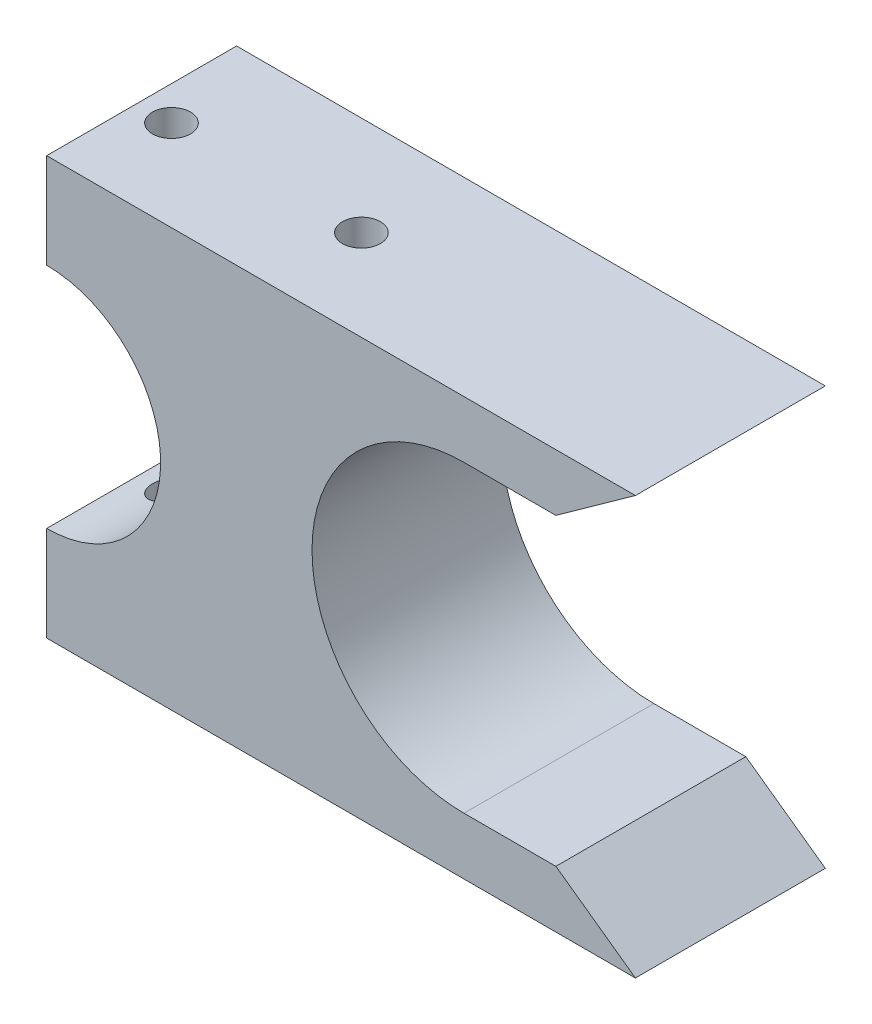
ISO-10303-21;
HEADER;
FILE_DESCRIPTION(('STEP AP214'),'2;1');
FILE_NAME('part.step','',(''),(''),'','','');
FILE_SCHEMA(('AUTOMOTIVE_DESIGN { 1 0 10303 214 1 1 1 1 }'));
ENDSEC;
DATA;
#1=APPLICATION_CONTEXT('core data for automotive mechanical design processes');
#2=APPLICATION_PROTOCOL_DEFINITION('international standard','automotive_design',2000,#1);
#3=PRODUCT_CONTEXT('',#1,'mechanical');
#4=PRODUCT('Part','Part','',(#3));
#5=PRODUCT_RELATED_PRODUCT_CATEGORY('part','',(#4));
#6=PRODUCT_DEFINITION_FORMATION('','',#4);
#7=PRODUCT_DEFINITION_CONTEXT('part definition',#1,'design');
#8=PRODUCT_DEFINITION('design','',#6,#7);
#9=PRODUCT_DEFINITION_SHAPE('','',#8);
#10=(LENGTH_UNIT() NAMED_UNIT(*) SI_UNIT(.MILLI.,.METRE.));
#11=(NAMED_UNIT(*) PLANE_ANGLE_UNIT() SI_UNIT($,.RADIAN.));
#12=(NAMED_UNIT(*) SI_UNIT($,.STERADIAN.) SOLID_ANGLE_UNIT());
#13=UNCERTAINTY_MEASURE_WITH_UNIT(LENGTH_MEASURE(1.E-05),#10,'distance_accuracy_value','');
#14=(GEOMETRIC_REPRESENTATION_CONTEXT(3) GLOBAL_UNCERTAINTY_ASSIGNED_CONTEXT((#13)) GLOBAL_UNIT_ASSIGNED_CONTEXT((#10,
#11,#12)) REPRESENTATION_CONTEXT('',''));
#15=CARTESIAN_POINT('',(0.,0.,0.));
#16=DIRECTION('',(0.,0.,1.));
#17=DIRECTION('',(1.,0.,0.));
#18=AXIS2_PLACEMENT_3D('',#15,#16,#17);
#19=CARTESIAN_POINT('',(-13.9719150316954,11.,10.));
#20=DIRECTION('',(1.,0.,0.));
#21=DIRECTION('',(0.,0.,-1.));
#22=AXIS2_PLACEMENT_3D('',#19,#20,#21);
#23=PLANE('',#22);
#24=DIRECTION('',(0.,-1.,0.));
#25=VECTOR('',#24,1.);
#26=CARTESIAN_POINT('',(-13.9719150316954,11.,0.));
#27=LINE('',#26,#25);
#28=CARTESIAN_POINT('',(-13.9719150316954,11.,0.));
#29=VERTEX_POINT('',#28);
#30=CARTESIAN_POINT('',(-13.9719150316954,6.,0.));
#31=VERTEX_POINT('',#30);
#32=EDGE_CURVE('E130',#29,#31,#27,.T.);
#33=ORIENTED_EDGE('',*,*,#32,.T.);
#34=DIRECTION('',(0.,0.,-1.));
#35=VECTOR('',#34,1.);
#36=CARTESIAN_POINT('',(-13.9719150316954,6.,10.));
#37=LINE('',#36,#35);
#38=CARTESIAN_POINT('',(-13.9719150316954,6.,10.));
#39=VERTEX_POINT('',#38);
#40=EDGE_CURVE('E11',#39,#31,#37,.T.);
#41=ORIENTED_EDGE('',*,*,#40,.F.);
#42=DIRECTION('',(0.,-1.,0.));
#43=VECTOR('',#42,1.);
#44=CARTESIAN_POINT('',(-13.9719150316954,11.,10.));
#45=LINE('',#44,#43);
#46=CARTESIAN_POINT('',(-13.9719150316954,11.,10.));
#47=VERTEX_POINT('',#46);
#48=EDGE_CURVE('E148',#47,#39,#45,.T.);
#49=ORIENTED_EDGE('',*,*,#48,.F.);
#50=DIRECTION('',(0.,0.,-1.));
#51=VECTOR('',#50,1.);
#52=CARTESIAN_POINT('',(-13.9719150316954,11.,10.));
#53=LINE('',#52,#51);
#54=EDGE_CURVE('E126',#47,#29,#53,.T.);
#55=ORIENTED_EDGE('',*,*,#54,.T.);
#56=EDGE_LOOP('',(#33,#41,#49,#55));
#57=FACE_BOUND('',#56,.T.);
#58=ADVANCED_FACE('F42',(#57),#23,.F.);
#59=CARTESIAN_POINT('',(-13.9719150316954,0.,10.));
#60=DIRECTION('',(0.,0.,-1.));
#61=DIRECTION('',(-1.,0.,0.));
#62=AXIS2_PLACEMENT_3D('',#59,#60,#61);
#63=CYLINDRICAL_SURFACE('',#62,6.);
#64=CARTESIAN_POINT('',(-12.1745205373334,-5.72445395052117,6.22427573403661));
#65=CARTESIAN_POINT('',(-12.2303560263032,-5.74198475317125,6.22427421741959));
#66=CARTESIAN_POINT('',(-12.2864707697377,-5.75869884831585,6.21958843247634));
#67=CARTESIAN_POINT('',(-12.3976859292133,-5.79009024664277,6.20068753949421));
#68=CARTESIAN_POINT('',(-12.4527859569581,-5.80476678361486,6.18646885832605));
#69=CARTESIAN_POINT('',(-12.5603533138965,-5.83185865027265,6.14860681839455));
#70=CARTESIAN_POINT('',(-12.6128163953193,-5.84427041127206,6.12494876943051));
#71=CARTESIAN_POINT('',(-12.7132721442532,-5.86672567427537,6.0687039139969));
#72=CARTESIAN_POINT('',(-12.7612656340706,-5.87676961242923,6.03611875428442));
#73=CARTESIAN_POINT('',(-12.849770594221,-5.89429977550822,5.96400329942319));
#74=CARTESIAN_POINT('',(-12.8904650835414,-5.90185443826801,5.92471409241819));
#75=CARTESIAN_POINT('',(-12.9647771002944,-5.91498950051749,5.8396482354895));
#76=CARTESIAN_POINT('',(-12.9983951910958,-5.9205700571945,5.79387210249115));
#77=CARTESIAN_POINT('',(-13.0569438750368,-5.92989836811523,5.69801446302989));
#78=CARTESIAN_POINT('',(-13.0820166624467,-5.93367658734467,5.64802268051759));
#79=CARTESIAN_POINT('',(-13.1235077017253,-5.93975144756019,5.54448429415539));
#80=CARTESIAN_POINT('',(-13.1399261611389,-5.94204812407638,5.49093777558857));
#81=CARTESIAN_POINT('',(-13.1635770696567,-5.9453118803599,5.38196932438098));
#82=CARTESIAN_POINT('',(-13.1708346161125,-5.9462825933563,5.32655294453006));
#83=CARTESIAN_POINT('',(-13.1760300562808,-5.94698027031004,5.21527699033676));
#84=CARTESIAN_POINT('',(-13.1739679295507,-5.94670723153923,5.15941741502252));
#85=CARTESIAN_POINT('',(-13.1605821409134,-5.94489560002012,5.04881337509116));
#86=CARTESIAN_POINT('',(-13.1492541408148,-5.94335641447239,4.99406944511557));
#87=CARTESIAN_POINT('',(-13.1176715238276,-5.93889891193022,4.88727950221414));
#88=CARTESIAN_POINT('',(-13.0974170025345,-5.93598060970493,4.8352334604029));
#89=CARTESIAN_POINT('',(-13.0486058341363,-5.92858382299302,4.73533364138175));
#90=CARTESIAN_POINT('',(-13.0200519044498,-5.92410584908401,4.68747849863773));
#91=CARTESIAN_POINT('',(-12.9555234235957,-5.91337586373584,4.59729192362205));
#92=CARTESIAN_POINT('',(-12.9195491060715,-5.90712390815116,4.55496031750099));
#93=CARTESIAN_POINT('',(-12.8412827707284,-5.89264384011893,4.4769589710601));
#94=CARTESIAN_POINT('',(-12.7989870104907,-5.88441455528785,4.44129320538944));
#95=CARTESIAN_POINT('',(-12.7094219995698,-5.86585030537105,4.37757547440227));
#96=CARTESIAN_POINT('',(-12.6621527052274,-5.85551532180015,4.3495235759302));
#97=CARTESIAN_POINT('',(-12.563596594753,-5.83259988809157,4.30142309854288));
#98=CARTESIAN_POINT('',(-12.5122740214314,-5.81999781157659,4.28145822077442));
#99=CARTESIAN_POINT('',(-12.4075671012963,-5.79273187989704,4.25027627490168));
#100=CARTESIAN_POINT('',(-12.3541824798082,-5.77806774936537,4.23906037644963));
#101=CARTESIAN_POINT('',(-12.2451450804135,-5.74644117548867,4.22521299793434));
#102=CARTESIAN_POINT('',(-12.1894736446552,-5.72942111626551,4.22286150106131));
#103=CARTESIAN_POINT('',(-12.0789878572315,-5.69387376476382,4.22731389284813));
#104=CARTESIAN_POINT('',(-12.0241737264217,-5.67534609148326,4.23412010262388));
#105=CARTESIAN_POINT('',(-11.9140158883382,-5.63636698293885,4.25708400851638));
#106=CARTESIAN_POINT('',(-11.8587842218214,-5.615865659203,4.27369485323868));
#107=CARTESIAN_POINT('',(-11.7520675806708,-5.57454538747228,4.31607298031157));
#108=CARTESIAN_POINT('',(-11.7005838472488,-5.55372633699135,4.34184327954961));
#109=CARTESIAN_POINT('',(-11.6007604065539,-5.51186580896186,4.40308379610853));
#110=CARTESIAN_POINT('',(-11.5526136147971,-5.49084576864629,4.43888440936687));
#111=CARTESIAN_POINT('',(-11.4630874717055,-5.45052273753934,4.51896102598171));
#112=CARTESIAN_POINT('',(-11.4217085474063,-5.43121985513138,4.56323756376576));
#113=CARTESIAN_POINT('',(-11.3481141742477,-5.39604429216369,4.65809272976502));
#114=CARTESIAN_POINT('',(-11.3156929063767,-5.38009702022826,4.7084830066191));
#115=CARTESIAN_POINT('',(-11.2600728280974,-5.35227854883663,4.81513895987086));
#116=CARTESIAN_POINT('',(-11.2368655517442,-5.34040360903801,4.8713991825674));
#117=CARTESIAN_POINT('',(-11.2027114334756,-5.32276672447667,4.9821873743734));
#118=CARTESIAN_POINT('',(-11.1907754821761,-5.3165146148453,5.03633200615066));
#119=CARTESIAN_POINT('',(-11.1760396260742,-5.30878087206615,5.14617392908685));
#120=CARTESIAN_POINT('',(-11.1732335656542,-5.30729602471107,5.20187014856059));
#121=CARTESIAN_POINT('',(-11.1767356630798,-5.30914037639137,5.30780684069654));
#122=CARTESIAN_POINT('',(-11.1822401467101,-5.31204510440246,5.35808391191686));
#123=CARTESIAN_POINT('',(-11.2006515149787,-5.32167315887307,5.4568778260449));
#124=CARTESIAN_POINT('',(-11.213558541865,-5.32839655871252,5.50539463510821));
#125=CARTESIAN_POINT('',(-11.2462930285912,-5.34521482015498,5.59963461465897));
#126=CARTESIAN_POINT('',(-11.2661501254549,-5.35532411205852,5.6453448198555));
#127=CARTESIAN_POINT('',(-11.3120508741512,-5.37826917026009,5.73279011930976));
#128=CARTESIAN_POINT('',(-11.3380962472841,-5.39110569504641,5.7745241030283));
#129=CARTESIAN_POINT('',(-11.3981277473951,-5.42003884788685,5.85675270957285));
#130=CARTESIAN_POINT('',(-11.432609299537,-5.43632246105458,5.89681931429448));
#131=CARTESIAN_POINT('',(-11.5070304622127,-5.47046805794327,5.97074164724692));
#132=CARTESIAN_POINT('',(-11.5469734198206,-5.48833100718448,6.00459353669269));
#133=CARTESIAN_POINT('',(-11.6356206422367,-5.52668838425846,6.06858968827896));
#134=CARTESIAN_POINT('',(-11.6848016302172,-5.54726730357483,6.09802436962138));
#135=CARTESIAN_POINT('',(-11.7874180639088,-5.5884724881989,6.14807661609864));
#136=CARTESIAN_POINT('',(-11.8408516228064,-5.60909872860905,6.16869806597));
#137=CARTESIAN_POINT('',(-11.9407477833069,-5.6459421805186,6.19769502535803));
#138=CARTESIAN_POINT('',(-11.9867236736132,-5.66228220439649,6.20761066493147));
#139=CARTESIAN_POINT('',(-12.0799061861796,-5.69409567683618,6.22090138501089));
#140=CARTESIAN_POINT('',(-12.1271127034296,-5.70956919898464,6.22427702173963));
#141=CARTESIAN_POINT('',(-12.1745205373334,-5.72445395052117,6.22427573403661));
#142=B_SPLINE_CURVE_WITH_KNOTS('',3,(#64,#65,#66,#67,#68,#69,#70,#71,#72,#73,#74,#75,#76,#77,
#78,#79,#80,#81,#82,#83,#84,#85,#86,#87,#88,#89,#90,#91,#92,#93,#94,#95,#96,#97,#98,#99,#100,
#101,#102,#103,#104,#105,#106,#107,#108,#109,#110,#111,#112,#113,#114,#115,#116,#117,#118,#119,
#120,#121,#122,#123,#124,#125,#126,#127,#128,#129,#130,#131,#132,#133,#134,#135,#136,#137,#138,
#139,#140,#141),.UNSPECIFIED.,.T.,.F.,(4,2,2,2,2,2,2,2,2,2,2,2,2,2,2,2,2,2,2,2,2,2,2,2,2,2,2,2,
2,2,2,2,2,2,2,2,2,2,4),(0.,0.175401601977453,0.350868984933521,0.526610514267354,
0.702319646896672,0.872690329764026,1.04304744388574,1.21041290393258,1.3777743500995,
1.54467628851016,1.71157859301662,1.87855908430574,2.0455377874197,2.21246187930884,
2.37938071611244,2.54639876648593,2.71341828311406,2.88212481467249,3.05085389676621,
3.22486970039131,3.3989296184396,3.58174453277857,3.76461971750875,3.95442081450711,
4.14423388286809,4.3292320750565,4.51405989274238,4.68052262989961,4.84687311012696,
4.99813369481428,5.14939718623679,5.30131372783459,5.45327257535679,5.61852867963051,
5.78388652046403,5.96578486632277,6.14760295129602,6.29654258588277,6.44546955269978),.UNSPECIFIED.);
#143=CARTESIAN_POINT('',(-12.1745205373334,-5.72445395052117,6.22427573403661));
#144=VERTEX_POINT('',#143);
#145=EDGE_CURVE('E204',#144,#144,#142,.T.);
#146=ORIENTED_EDGE('',*,*,#145,.T.);
#147=EDGE_LOOP('',(#146));
#148=FACE_BOUND('',#147,.T.);
#149=CARTESIAN_POINT('',(-12.1745205373334,5.72445395052117,6.22427573403661));
#150=CARTESIAN_POINT('',(-12.1148566510679,5.70571882603655,6.22427325405878));
#151=CARTESIAN_POINT('',(-12.0554436235866,5.68602952377531,6.2189204132466));
#152=CARTESIAN_POINT('',(-11.9388503734701,5.64539425725784,6.19791826430996));
#153=CARTESIAN_POINT('',(-11.8816738140268,5.62444636302394,6.18225275616932));
#154=CARTESIAN_POINT('',(-11.7711899194682,5.58214134092721,6.14122194283549));
#155=CARTESIAN_POINT('',(-11.7178766250048,5.56078491049281,6.11587197258771));
#156=CARTESIAN_POINT('',(-11.6163861141717,5.5185602454345,6.05611354695092));
#157=CARTESIAN_POINT('',(-11.5682082006784,5.49769194484835,6.02170632328238));
#158=CARTESIAN_POINT('',(-11.4777627981796,5.45726022140809,5.94408239049838));
#159=CARTESIAN_POINT('',(-11.435572351765,5.43771525267571,5.90076584994277));
#160=CARTESIAN_POINT('',(-11.3592345231515,5.40145262137448,5.80649768011935));
#161=CARTESIAN_POINT('',(-11.3250846716563,5.38473409124183,5.75554840277864));
#162=CARTESIAN_POINT('',(-11.2681615239688,5.35636714720235,5.65070826424484));
#163=CARTESIAN_POINT('',(-11.2448096272608,5.34446675376986,5.59720153668526));
#164=CARTESIAN_POINT('',(-11.2076620044669,5.32534967373102,5.48619193218586));
#165=CARTESIAN_POINT('',(-11.1938564932572,5.31812819168198,5.42869321381198));
#166=CARTESIAN_POINT('',(-11.1775472589137,5.30957459587501,5.31817301862825));
#167=CARTESIAN_POINT('',(-11.1739709688127,5.30768389605123,5.26535124998596));
#168=CARTESIAN_POINT('',(-11.175206526169,5.30833525778753,5.15984076000554));
#169=CARTESIAN_POINT('',(-11.180015858583,5.31087599025796,5.10715200352018));
#170=CARTESIAN_POINT('',(-11.1972849999965,5.31991670752661,5.00636486888991));
#171=CARTESIAN_POINT('',(-11.2093186359209,5.32619599003695,4.95817211997133));
#172=CARTESIAN_POINT('',(-11.2401475002039,5.3420730840744,4.86458780673435));
#173=CARTESIAN_POINT('',(-11.2589438255353,5.35167143397609,4.81919669826905));
#174=CARTESIAN_POINT('',(-11.3036772951215,5.37411951278672,4.73007209886607));
#175=CARTESIAN_POINT('',(-11.3299151115799,5.38710372572467,4.68652413293382));
#176=CARTESIAN_POINT('',(-11.3882371347444,5.41531689891656,4.60435655651077));
#177=CARTESIAN_POINT('',(-11.4203236793319,5.43054675634332,4.56573892733166));
#178=CARTESIAN_POINT('',(-11.4930762469142,5.46416697070262,4.49034692572154));
#179=CARTESIAN_POINT('',(-11.5342849146889,5.48272127653036,4.45416896290542));
#180=CARTESIAN_POINT('',(-11.6217537677328,5.52078060665892,4.38915813007245));
#181=CARTESIAN_POINT('',(-11.6680161766065,5.54028604734463,4.36032851201344));
#182=CARTESIAN_POINT('',(-11.7684898458278,5.58104692319745,4.30853225324194));
#183=CARTESIAN_POINT('',(-11.8230415890893,5.60231563600438,4.28623336145923));
#184=CARTESIAN_POINT('',(-11.9354629148231,5.64415269681166,4.25148934430645));
#185=CARTESIAN_POINT('',(-11.993332929604,5.66472095299673,4.23904550600744));
#186=CARTESIAN_POINT('',(-12.1115121041498,5.70463234154891,4.22446976995521));
#187=CARTESIAN_POINT('',(-12.1718411471443,5.72395942956532,4.22245330892523));
#188=CARTESIAN_POINT('',(-12.2925041605125,5.7605164329322,4.22942469163672));
#189=CARTESIAN_POINT('',(-12.3528381249741,5.77774692325218,4.23840951088331));
#190=CARTESIAN_POINT('',(-12.4688582725832,5.80898205203835,4.26679324647409));
#191=CARTESIAN_POINT('',(-12.5246319798591,5.82309570226963,4.28571370534099));
#192=CARTESIAN_POINT('',(-12.6324520330532,5.84883843274582,4.33333875704672));
#193=CARTESIAN_POINT('',(-12.6844994618043,5.86046823674496,4.36204049342857));
#194=CARTESIAN_POINT('',(-12.7806232684616,5.88074188869403,4.42688154541921));
#195=CARTESIAN_POINT('',(-12.8249635169334,5.88950301082135,4.46259366083224));
#196=CARTESIAN_POINT('',(-12.9071206384709,5.90491007512215,4.54124612762174));
#197=CARTESIAN_POINT('',(-12.9449384190217,5.91155631165314,4.58418547181301));
#198=CARTESIAN_POINT('',(-13.0119763324662,5.92280755011472,4.67493585049483));
#199=CARTESIAN_POINT('',(-13.0413814435046,5.92745781950431,4.72260480414351));
#200=CARTESIAN_POINT('',(-13.09186573689,5.93516371318781,4.82228269302316));
#201=CARTESIAN_POINT('',(-13.1129452279045,5.93821939660142,4.87429146727119));
#202=CARTESIAN_POINT('',(-13.1460420059727,5.94291289899523,4.98087500678622));
#203=CARTESIAN_POINT('',(-13.1581063461038,5.94455808655598,5.03543484686183));
#204=CARTESIAN_POINT('',(-13.1729929758671,5.94657724864444,5.14582445092953));
#205=CARTESIAN_POINT('',(-13.1758152475974,5.9469512207098,5.20165421738127));
#206=CARTESIAN_POINT('',(-13.1721325809916,5.94645703312982,5.31301675934153));
#207=CARTESIAN_POINT('',(-13.165624805782,5.94558849568994,5.36854943936476));
#208=CARTESIAN_POINT('',(-13.1434716491118,5.94254197268611,5.47772417599832));
#209=CARTESIAN_POINT('',(-13.1278262955223,5.94036399111617,5.53136623837479));
#210=CARTESIAN_POINT('',(-13.0878715933589,5.93454902699509,5.6352328172364));
#211=CARTESIAN_POINT('',(-13.0635627198286,5.93091212443904,5.6854575209245));
#212=CARTESIAN_POINT('',(-13.0070279435472,5.92197672834625,5.78106595739652));
#213=CARTESIAN_POINT('',(-12.9748025270926,5.9166783368657,5.82644998728726));
#214=CARTESIAN_POINT('',(-12.90344676244,5.90420894237724,5.91110196012794));
#215=CARTESIAN_POINT('',(-12.8643180777404,5.89703839030939,5.95037137225101));
#216=CARTESIAN_POINT('',(-12.7803702302155,5.88065014302111,6.0217608278203));
#217=CARTESIAN_POINT('',(-12.7355499773574,5.87143205540849,6.0538794985242));
#218=CARTESIAN_POINT('',(-12.6413065024808,5.85079668763962,6.11036298128309));
#219=CARTESIAN_POINT('',(-12.5918541117342,5.83936490984106,6.1346737028624));
#220=CARTESIAN_POINT('',(-12.4901432515242,5.81438614347365,6.17473108686716));
#221=CARTESIAN_POINT('',(-12.4378872911291,5.8008410261934,6.19048527103));
#222=CARTESIAN_POINT('',(-12.3502171957958,5.77679871014163,6.20936413756807));
#223=CARTESIAN_POINT('',(-12.3151643124077,5.76684640325528,6.21496632376688));
#224=CARTESIAN_POINT('',(-12.2448854592718,5.746191029909,6.22242282743309));
#225=CARTESIAN_POINT('',(-12.2096594918261,5.7354879734098,6.22427719461576));
#226=CARTESIAN_POINT('',(-12.1745205373334,5.72445395052117,6.22427573403661));
#227=B_SPLINE_CURVE_WITH_KNOTS('',3,(#149,#150,#151,#152,#153,#154,#155,#156,#157,#158,#159,
#160,#161,#162,#163,#164,#165,#166,#167,#168,#169,#170,#171,#172,#173,#174,#175,#176,#177,#178,
#179,#180,#181,#182,#183,#184,#185,#186,#187,#188,#189,#190,#191,#192,#193,#194,#195,#196,#197,
#198,#199,#200,#201,#202,#203,#204,#205,#206,#207,#208,#209,#210,#211,#212,#213,#214,#215,#216,
#217,#218,#219,#220,#221,#222,#223,#224,#225,#226),.UNSPECIFIED.,.T.,.F.,(4,2,2,2,2,2,2,2,2,2,2,
2,2,2,2,2,2,2,2,2,2,2,2,2,2,2,2,2,2,2,2,2,2,2,2,2,2,2,4),(0.,0.187470051649427,0.37523530222081,
0.562704458423271,0.750148133345429,0.939819361425017,1.12943226457489,1.30716863711347,
1.48472255727314,1.64282246751938,1.80087496807788,1.9504115294167,2.09997235795744,
2.25674631598574,2.41358307841698,2.58652370006748,2.75954072300188,2.94663278612687,
3.13374927946843,3.32293288613178,3.51206449372009,3.69282633853698,3.87353544008021,
4.04549847191147,4.21743755882039,4.38523951643547,4.55303525230601,4.71994896903065,
4.88686300906821,5.05382781138846,5.22079210444283,5.38774724381474,5.55469213005023,
5.72159684195489,5.88853356731986,6.0566029975519,6.22452444401309,6.33493610861796,
6.44534630858923),.UNSPECIFIED.);
#228=CARTESIAN_POINT('',(-12.1745205373334,5.72445395052117,6.22427573403661));
#229=VERTEX_POINT('',#228);
#230=EDGE_CURVE('E197',#229,#229,#227,.T.);
#231=ORIENTED_EDGE('',*,*,#230,.T.);
#232=EDGE_LOOP('',(#231));
#233=FACE_BOUND('',#232,.T.);
#234=CARTESIAN_POINT('',(-13.9719150316954,0.,0.));
#235=DIRECTION('',(0.,0.,-1.));
#236=DIRECTION('',(1.,0.,0.));
#237=AXIS2_PLACEMENT_3D('',#234,#235,#236);
#238=CIRCLE('',#237,6.);
#239=CARTESIAN_POINT('',(-13.9719150316954,-6.,0.));
#240=VERTEX_POINT('',#239);
#241=EDGE_CURVE('E134',#31,#240,#238,.T.);
#242=ORIENTED_EDGE('',*,*,#241,.T.);
#243=DIRECTION('',(0.,0.,-1.));
#244=VECTOR('',#243,1.);
#245=CARTESIAN_POINT('',(-13.9719150316954,-6.,10.));
#246=LINE('',#245,#244);
#247=CARTESIAN_POINT('',(-13.9719150316954,-6.,10.));
#248=VERTEX_POINT('',#247);
#249=EDGE_CURVE('E422',#248,#240,#246,.T.);
#250=ORIENTED_EDGE('',*,*,#249,.F.);
#251=CARTESIAN_POINT('',(-13.9719150316954,0.,10.));
#252=DIRECTION('',(0.,0.,-1.));
#253=DIRECTION('',(1.,0.,0.));
#254=AXIS2_PLACEMENT_3D('',#251,#252,#253);
#255=CIRCLE('',#254,6.);
#256=EDGE_CURVE('E94',#39,#248,#255,.T.);
#257=ORIENTED_EDGE('',*,*,#256,.F.);
#258=ORIENTED_EDGE('',*,*,#40,.T.);
#259=EDGE_LOOP('',(#242,#250,#257,#258));
#260=FACE_BOUND('',#259,.T.);
#261=ADVANCED_FACE('F181',(#148,#233,#260),#63,.F.);
#262=CARTESIAN_POINT('',(8.,0.,10.));
#263=DIRECTION('',(0.,0.,-1.));
#264=DIRECTION('',(-1.,0.,0.));
#265=AXIS2_PLACEMENT_3D('',#262,#263,#264);
#266=CYLINDRICAL_SURFACE('',#265,8.);
#267=CARTESIAN_POINT('',(8.,0.,0.));
#268=DIRECTION('',(0.,0.,-1.));
#269=DIRECTION('',(1.,0.,0.));
#270=AXIS2_PLACEMENT_3D('',#267,#268,#269);
#271=CIRCLE('',#270,8.);
#272=CARTESIAN_POINT('',(8.,-8.,0.));
#273=VERTEX_POINT('',#272);
#274=CARTESIAN_POINT('',(8.,8.,0.));
#275=VERTEX_POINT('',#274);
#276=EDGE_CURVE('E139',#273,#275,#271,.T.);
#277=ORIENTED_EDGE('',*,*,#276,.T.);
#278=DIRECTION('',(0.,0.,-1.));
#279=VECTOR('',#278,1.);
#280=CARTESIAN_POINT('',(8.,8.,10.));
#281=LINE('',#280,#279);
#282=CARTESIAN_POINT('',(8.,8.,10.));
#283=VERTEX_POINT('',#282);
#284=EDGE_CURVE('E51',#283,#275,#281,.T.);
#285=ORIENTED_EDGE('',*,*,#284,.F.);
#286=CARTESIAN_POINT('',(8.,0.,10.));
#287=DIRECTION('',(0.,0.,-1.));
#288=DIRECTION('',(1.,0.,0.));
#289=AXIS2_PLACEMENT_3D('',#286,#287,#288);
#290=CIRCLE('',#289,8.);
#291=CARTESIAN_POINT('',(8.,-8.,10.));
#292=VERTEX_POINT('',#291);
#293=EDGE_CURVE('E109',#292,#283,#290,.T.);
#294=ORIENTED_EDGE('',*,*,#293,.F.);
#295=DIRECTION('',(0.,0.,-1.));
#296=VECTOR('',#295,1.);
#297=CARTESIAN_POINT('',(8.,-8.,10.));
#298=LINE('',#297,#296);
#299=EDGE_CURVE('E426',#292,#273,#298,.T.);
#300=ORIENTED_EDGE('',*,*,#299,.T.);
#301=EDGE_LOOP('',(#277,#285,#294,#300));
#302=FACE_BOUND('',#301,.T.);
#303=ADVANCED_FACE('F185',(#302),#266,.F.);
#304=CARTESIAN_POINT('',(12.8418780761755,8.,10.));
#305=DIRECTION('',(0.,1.,0.));
#306=DIRECTION('',(-1.,0.,0.));
#307=AXIS2_PLACEMENT_3D('',#304,#305,#306);
#308=PLANE('',#307);
#309=DIRECTION('',(1.,0.,0.));
#310=VECTOR('',#309,1.);
#311=CARTESIAN_POINT('',(12.8418780761755,8.,0.));
#312=LINE('',#311,#310);
#313=CARTESIAN_POINT('',(12.8418780761755,8.,0.));
#314=VERTEX_POINT('',#313);
#315=EDGE_CURVE('E118',#275,#314,#312,.T.);
#316=ORIENTED_EDGE('',*,*,#315,.T.);
#317=DIRECTION('',(0.,0.,-1.));
#318=VECTOR('',#317,1.);
#319=CARTESIAN_POINT('',(12.8418780761755,8.,10.));
#320=LINE('',#319,#318);
#321=CARTESIAN_POINT('',(12.8418780761755,8.,10.));
#322=VERTEX_POINT('',#321);
#323=EDGE_CURVE('E115',#322,#314,#320,.T.);
#324=ORIENTED_EDGE('',*,*,#323,.F.);
#325=DIRECTION('',(1.,0.,0.));
#326=VECTOR('',#325,1.);
#327=CARTESIAN_POINT('',(12.8418780761755,8.,10.));
#328=LINE('',#327,#326);
#329=EDGE_CURVE('E102',#283,#322,#328,.T.);
#330=ORIENTED_EDGE('',*,*,#329,.F.);
#331=ORIENTED_EDGE('',*,*,#284,.T.);
#332=EDGE_LOOP('',(#316,#324,#330,#331));
#333=FACE_BOUND('',#332,.T.);
#334=ADVANCED_FACE('F116',(#333),#308,.F.);
#335=CARTESIAN_POINT('',(17.0280849683046,11.,10.));
#336=DIRECTION('',(-0.582504196756848,0.812827694385877,0.));
#337=DIRECTION('',(-0.812827694385877,-0.582504196756848,0.));
#338=AXIS2_PLACEMENT_3D('',#335,#336,#337);
#339=PLANE('',#338);
#340=DIRECTION('',(0.812827694385877,0.582504196756848,0.));
#341=VECTOR('',#340,1.);
#342=CARTESIAN_POINT('',(17.0280849683046,11.,0.));
#343=LINE('',#342,#341);
#344=CARTESIAN_POINT('',(17.0280849683046,11.,0.));
#345=VERTEX_POINT('',#344);
#346=EDGE_CURVE('E80',#314,#345,#343,.T.);
#347=ORIENTED_EDGE('',*,*,#346,.T.);
#348=DIRECTION('',(0.,0.,-1.));
#349=VECTOR('',#348,1.);
#350=CARTESIAN_POINT('',(17.0280849683046,11.,10.));
#351=LINE('',#350,#349);
#352=CARTESIAN_POINT('',(17.0280849683046,11.,10.));
#353=VERTEX_POINT('',#352);
#354=EDGE_CURVE('E120',#353,#345,#351,.T.);
#355=ORIENTED_EDGE('',*,*,#354,.F.);
#356=DIRECTION('',(0.812827694385877,0.582504196756848,0.));
#357=VECTOR('',#356,1.);
#358=CARTESIAN_POINT('',(17.0280849683046,11.,10.));
#359=LINE('',#358,#357);
#360=EDGE_CURVE('E106',#322,#353,#359,.T.);
#361=ORIENTED_EDGE('',*,*,#360,.F.);
#362=ORIENTED_EDGE('',*,*,#323,.T.);
#363=EDGE_LOOP('',(#347,#355,#361,#362));
#364=FACE_BOUND('',#363,.T.);
#365=ADVANCED_FACE('F122',(#364),#339,.F.);
#366=CARTESIAN_POINT('',(-13.9719150316954,11.,10.));
#367=DIRECTION('',(0.,-1.,0.));
#368=DIRECTION('',(0.,0.,-1.));
#369=AXIS2_PLACEMENT_3D('',#366,#367,#368);
#370=PLANE('',#369);
#371=CARTESIAN_POINT('',(-12.1745205373334,11.,5.22427573403661));
#372=DIRECTION('',(0.,1.,0.));
#373=DIRECTION('',(0.,0.,1.));
#374=AXIS2_PLACEMENT_3D('',#371,#372,#373);
#375=CIRCLE('',#374,1.);
#376=CARTESIAN_POINT('',(-12.1745205373334,11.,6.22427573403661));
#377=VERTEX_POINT('',#376);
#378=EDGE_CURVE('E369',#377,#377,#375,.T.);
#379=ORIENTED_EDGE('',*,*,#378,.F.);
#380=EDGE_LOOP('',(#379));
#381=FACE_BOUND('',#380,.T.);
#382=CARTESIAN_POINT('',(-2.17452053733344,11.,5.22427573403661));
#383=DIRECTION('',(0.,1.,0.));
#384=DIRECTION('',(0.,0.,1.));
#385=AXIS2_PLACEMENT_3D('',#382,#383,#384);
#386=CIRCLE('',#385,1.);
#387=CARTESIAN_POINT('',(-2.17452053733344,11.,6.22427573403661));
#388=VERTEX_POINT('',#387);
#389=EDGE_CURVE('E379',#388,#388,#386,.T.);
#390=ORIENTED_EDGE('',*,*,#389,.F.);
#391=EDGE_LOOP('',(#390));
#392=FACE_BOUND('',#391,.T.);
#393=DIRECTION('',(-1.,0.,0.));
#394=VECTOR('',#393,1.);
#395=CARTESIAN_POINT('',(-13.9719150316954,11.,0.));
#396=LINE('',#395,#394);
#397=EDGE_CURVE('E86',#345,#29,#396,.T.);
#398=ORIENTED_EDGE('',*,*,#397,.T.);
#399=ORIENTED_EDGE('',*,*,#54,.F.);
#400=DIRECTION('',(-1.,0.,0.));
#401=VECTOR('',#400,1.);
#402=CARTESIAN_POINT('',(-13.9719150316954,11.,10.));
#403=LINE('',#402,#401);
#404=EDGE_CURVE('E59',#353,#47,#403,.T.);
#405=ORIENTED_EDGE('',*,*,#404,.F.);
#406=ORIENTED_EDGE('',*,*,#354,.T.);
#407=EDGE_LOOP('',(#398,#399,#405,#406));
#408=FACE_BOUND('',#407,.T.);
#409=ADVANCED_FACE('F165',(#381,#392,#408),#370,.F.);
#410=CARTESIAN_POINT('',(-13.9719150316954,0.,10.));
#411=DIRECTION('',(0.,0.,1.));
#412=DIRECTION('',(1.,0.,0.));
#413=AXIS2_PLACEMENT_3D('',#410,#411,#412);
#414=PLANE('',#413);
#415=ORIENTED_EDGE('',*,*,#48,.T.);
#416=ORIENTED_EDGE('',*,*,#256,.T.);
#417=DIRECTION('',(0.,1.,0.));
#418=VECTOR('',#417,1.);
#419=CARTESIAN_POINT('',(-13.9719150316954,-11.,10.));
#420=LINE('',#419,#418);
#421=CARTESIAN_POINT('',(-13.9719150316954,-11.,10.));
#422=VERTEX_POINT('',#421);
#423=EDGE_CURVE('E211',#422,#248,#420,.T.);
#424=ORIENTED_EDGE('',*,*,#423,.F.);
#425=DIRECTION('',(-1.,0.,0.));
#426=VECTOR('',#425,1.);
#427=CARTESIAN_POINT('',(-13.9719150316954,-11.,10.));
#428=LINE('',#427,#426);
#429=CARTESIAN_POINT('',(17.0280849683046,-11.,10.));
#430=VERTEX_POINT('',#429);
#431=EDGE_CURVE('E449',#430,#422,#428,.T.);
#432=ORIENTED_EDGE('',*,*,#431,.F.);
#433=DIRECTION('',(0.812827694385877,-0.582504196756848,0.));
#434=VECTOR('',#433,1.);
#435=CARTESIAN_POINT('',(17.0280849683046,-11.,10.));
#436=LINE('',#435,#434);
#437=CARTESIAN_POINT('',(12.8418780761755,-8.,10.));
#438=VERTEX_POINT('',#437);
#439=EDGE_CURVE('E445',#438,#430,#436,.T.);
#440=ORIENTED_EDGE('',*,*,#439,.F.);
#441=DIRECTION('',(1.,0.,0.));
#442=VECTOR('',#441,1.);
#443=CARTESIAN_POINT('',(12.8418780761755,-8.,10.));
#444=LINE('',#443,#442);
#445=EDGE_CURVE('E427',#292,#438,#444,.T.);
#446=ORIENTED_EDGE('',*,*,#445,.F.);
#447=ORIENTED_EDGE('',*,*,#293,.T.);
#448=ORIENTED_EDGE('',*,*,#329,.T.);
#449=ORIENTED_EDGE('',*,*,#360,.T.);
#450=ORIENTED_EDGE('',*,*,#404,.T.);
#451=EDGE_LOOP('',(#415,#416,#424,#432,#440,#446,#447,#448,#449,#450));
#452=FACE_BOUND('',#451,.T.);
#453=ADVANCED_FACE('F104',(#452),#414,.T.);
#454=CARTESIAN_POINT('',(-13.9719150316954,0.,0.));
#455=DIRECTION('',(0.,0.,1.));
#456=DIRECTION('',(1.,0.,0.));
#457=AXIS2_PLACEMENT_3D('',#454,#455,#456);
#458=PLANE('',#457);
#459=ORIENTED_EDGE('',*,*,#32,.F.);
#460=ORIENTED_EDGE('',*,*,#397,.F.);
#461=ORIENTED_EDGE('',*,*,#346,.F.);
#462=ORIENTED_EDGE('',*,*,#315,.F.);
#463=ORIENTED_EDGE('',*,*,#276,.F.);
#464=DIRECTION('',(1.,0.,0.));
#465=VECTOR('',#464,1.);
#466=CARTESIAN_POINT('',(12.8418780761755,-8.,0.));
#467=LINE('',#466,#465);
#468=CARTESIAN_POINT('',(12.8418780761755,-8.,0.));
#469=VERTEX_POINT('',#468);
#470=EDGE_CURVE('E414',#273,#469,#467,.T.);
#471=ORIENTED_EDGE('',*,*,#470,.T.);
#472=DIRECTION('',(0.812827694385877,-0.582504196756848,0.));
#473=VECTOR('',#472,1.);
#474=CARTESIAN_POINT('',(17.0280849683046,-11.,0.));
#475=LINE('',#474,#473);
#476=CARTESIAN_POINT('',(17.0280849683046,-11.,0.));
#477=VERTEX_POINT('',#476);
#478=EDGE_CURVE('E410',#469,#477,#475,.T.);
#479=ORIENTED_EDGE('',*,*,#478,.T.);
#480=DIRECTION('',(-1.,0.,0.));
#481=VECTOR('',#480,1.);
#482=CARTESIAN_POINT('',(-13.9719150316954,-11.,0.));
#483=LINE('',#482,#481);
#484=CARTESIAN_POINT('',(-13.9719150316954,-11.,0.));
#485=VERTEX_POINT('',#484);
#486=EDGE_CURVE('E397',#477,#485,#483,.T.);
#487=ORIENTED_EDGE('',*,*,#486,.T.);
#488=DIRECTION('',(0.,1.,0.));
#489=VECTOR('',#488,1.);
#490=CARTESIAN_POINT('',(-13.9719150316954,-11.,0.));
#491=LINE('',#490,#489);
#492=EDGE_CURVE('E210',#485,#240,#491,.T.);
#493=ORIENTED_EDGE('',*,*,#492,.T.);
#494=ORIENTED_EDGE('',*,*,#241,.F.);
#495=EDGE_LOOP('',(#459,#460,#461,#462,#463,#471,#479,#487,#493,#494));
#496=FACE_BOUND('',#495,.T.);
#497=ADVANCED_FACE('F157',(#496),#458,.F.);
#498=CARTESIAN_POINT('',(-13.9719150316954,-11.,10.));
#499=DIRECTION('',(-1.,0.,0.));
#500=DIRECTION('',(0.,0.,1.));
#501=AXIS2_PLACEMENT_3D('',#498,#499,#500);
#502=PLANE('',#501);
#503=ORIENTED_EDGE('',*,*,#492,.F.);
#504=DIRECTION('',(0.,0.,-1.));
#505=VECTOR('',#504,1.);
#506=CARTESIAN_POINT('',(-13.9719150316954,-11.,10.));
#507=LINE('',#506,#505);
#508=EDGE_CURVE('E135',#422,#485,#507,.T.);
#509=ORIENTED_EDGE('',*,*,#508,.F.);
#510=ORIENTED_EDGE('',*,*,#423,.T.);
#511=ORIENTED_EDGE('',*,*,#249,.T.);
#512=EDGE_LOOP('',(#503,#509,#510,#511));
#513=FACE_BOUND('',#512,.T.);
#514=ADVANCED_FACE('F234',(#513),#502,.T.);
#515=CARTESIAN_POINT('',(-13.9719150316954,-11.,10.));
#516=DIRECTION('',(0.,-1.,0.));
#517=DIRECTION('',(0.,0.,-1.));
#518=AXIS2_PLACEMENT_3D('',#515,#516,#517);
#519=PLANE('',#518);
#520=CARTESIAN_POINT('',(-12.1745205373334,-11.,5.22427573403661));
#521=DIRECTION('',(0.,1.,0.));
#522=DIRECTION('',(0.,0.,1.));
#523=AXIS2_PLACEMENT_3D('',#520,#521,#522);
#524=CIRCLE('',#523,1.);
#525=CARTESIAN_POINT('',(-12.1745205373334,-11.,6.22427573403661));
#526=VERTEX_POINT('',#525);
#527=EDGE_CURVE('E373',#526,#526,#524,.T.);
#528=ORIENTED_EDGE('',*,*,#527,.T.);
#529=EDGE_LOOP('',(#528));
#530=FACE_BOUND('',#529,.T.);
#531=CARTESIAN_POINT('',(-2.17452053733344,-11.,5.22427573403661));
#532=DIRECTION('',(0.,1.,0.));
#533=DIRECTION('',(0.,0.,1.));
#534=AXIS2_PLACEMENT_3D('',#531,#532,#533);
#535=CIRCLE('',#534,1.);
#536=CARTESIAN_POINT('',(-2.17452053733344,-11.,6.22427573403661));
#537=VERTEX_POINT('',#536);
#538=EDGE_CURVE('E384',#537,#537,#535,.T.);
#539=ORIENTED_EDGE('',*,*,#538,.T.);
#540=EDGE_LOOP('',(#539));
#541=FACE_BOUND('',#540,.T.);
#542=ORIENTED_EDGE('',*,*,#486,.F.);
#543=DIRECTION('',(0.,0.,-1.));
#544=VECTOR('',#543,1.);
#545=CARTESIAN_POINT('',(17.0280849683046,-11.,10.));
#546=LINE('',#545,#544);
#547=EDGE_CURVE('E402',#430,#477,#546,.T.);
#548=ORIENTED_EDGE('',*,*,#547,.F.);
#549=ORIENTED_EDGE('',*,*,#431,.T.);
#550=ORIENTED_EDGE('',*,*,#508,.T.);
#551=EDGE_LOOP('',(#542,#548,#549,#550));
#552=FACE_BOUND('',#551,.T.);
#553=ADVANCED_FACE('F231',(#530,#541,#552),#519,.T.);
#554=CARTESIAN_POINT('',(17.0280849683046,-11.,10.));
#555=DIRECTION('',(0.582504196756848,0.812827694385877,0.));
#556=DIRECTION('',(-0.812827694385877,0.582504196756848,0.));
#557=AXIS2_PLACEMENT_3D('',#554,#555,#556);
#558=PLANE('',#557);
#559=ORIENTED_EDGE('',*,*,#478,.F.);
#560=DIRECTION('',(0.,0.,-1.));
#561=VECTOR('',#560,1.);
#562=CARTESIAN_POINT('',(12.8418780761755,-8.,10.));
#563=LINE('',#562,#561);
#564=EDGE_CURVE('E430',#438,#469,#563,.T.);
#565=ORIENTED_EDGE('',*,*,#564,.F.);
#566=ORIENTED_EDGE('',*,*,#439,.T.);
#567=ORIENTED_EDGE('',*,*,#547,.T.);
#568=EDGE_LOOP('',(#559,#565,#566,#567));
#569=FACE_BOUND('',#568,.T.);
#570=ADVANCED_FACE('F227',(#569),#558,.T.);
#571=CARTESIAN_POINT('',(12.8418780761755,-8.,10.));
#572=DIRECTION('',(0.,1.,0.));
#573=DIRECTION('',(-1.,0.,0.));
#574=AXIS2_PLACEMENT_3D('',#571,#572,#573);
#575=PLANE('',#574);
#576=ORIENTED_EDGE('',*,*,#470,.F.);
#577=ORIENTED_EDGE('',*,*,#299,.F.);
#578=ORIENTED_EDGE('',*,*,#445,.T.);
#579=ORIENTED_EDGE('',*,*,#564,.T.);
#580=EDGE_LOOP('',(#576,#577,#578,#579));
#581=FACE_BOUND('',#580,.T.);
#582=ADVANCED_FACE('F223',(#581),#575,.T.);
#583=CARTESIAN_POINT('',(-2.17452053733344,-11.,5.22427573403661));
#584=DIRECTION('',(0.,1.,0.));
#585=DIRECTION('',(0.,0.,1.));
#586=AXIS2_PLACEMENT_3D('',#583,#584,#585);
#587=CYLINDRICAL_SURFACE('',#586,1.);
#588=ORIENTED_EDGE('',*,*,#538,.F.);
#589=EDGE_LOOP('',(#588));
#590=FACE_BOUND('',#589,.T.);
#591=ORIENTED_EDGE('',*,*,#389,.T.);
#592=EDGE_LOOP('',(#591));
#593=FACE_BOUND('',#592,.T.);
#594=ADVANCED_FACE('F218',(#590,#593),#587,.F.);
#595=CARTESIAN_POINT('',(-12.1745205373334,-11.,5.22427573403661));
#596=DIRECTION('',(0.,1.,0.));
#597=DIRECTION('',(0.,0.,1.));
#598=AXIS2_PLACEMENT_3D('',#595,#596,#597);
#599=CYLINDRICAL_SURFACE('',#598,1.);
#600=ORIENTED_EDGE('',*,*,#527,.F.);
#601=EDGE_LOOP('',(#600));
#602=FACE_BOUND('',#601,.T.);
#603=ORIENTED_EDGE('',*,*,#145,.F.);
#604=EDGE_LOOP('',(#603));
#605=FACE_BOUND('',#604,.T.);
#606=ADVANCED_FACE('F213',(#602,#605),#599,.F.);
#607=ORIENTED_EDGE('',*,*,#378,.T.);
#608=EDGE_LOOP('',(#607));
#609=FACE_BOUND('',#608,.T.);
#610=ORIENTED_EDGE('',*,*,#230,.F.);
#611=EDGE_LOOP('',(#610));
#612=FACE_BOUND('',#611,.T.);
#613=ADVANCED_FACE('F217',(#609,#612),#599,.F.);
#614=CLOSED_SHELL('',(#58,#261,#303,#334,#365,#409,#453,#497,#514,#553,#570,#582,#594,#606,#613));
#615=MANIFOLD_SOLID_BREP('B2',#614);
#616=ADVANCED_BREP_SHAPE_REPRESENTATION('',(#18,#615),#14);
#617=SHAPE_DEFINITION_REPRESENTATION(#9,#616);
ENDSEC;
END-ISO-10303-21;
